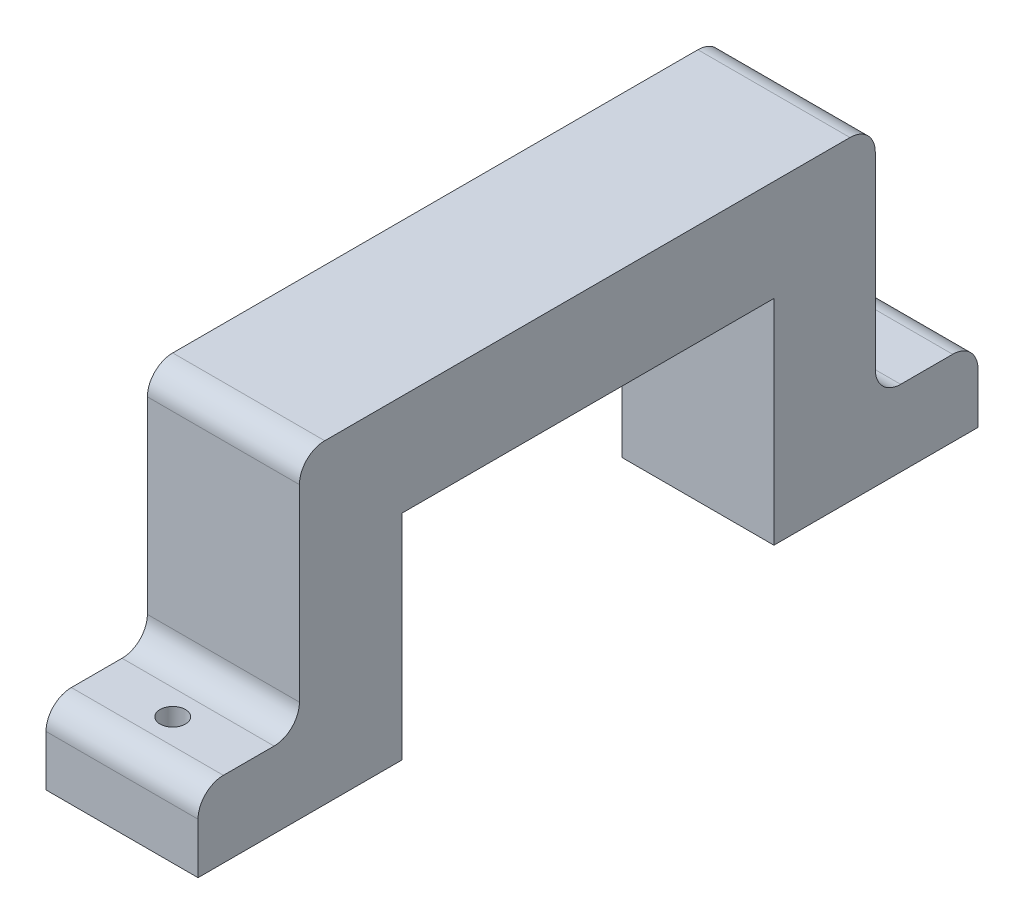
ISO-10303-21;
HEADER;
FILE_DESCRIPTION(('STEP AP214'),'2;1');
FILE_NAME('part.step','',(''),(''),'','','');
FILE_SCHEMA(('AUTOMOTIVE_DESIGN { 1 0 10303 214 1 1 1 1 }'));
ENDSEC;
DATA;
#1=APPLICATION_CONTEXT('core data for automotive mechanical design processes');
#2=APPLICATION_PROTOCOL_DEFINITION('international standard','automotive_design',2000,#1);
#3=PRODUCT_CONTEXT('',#1,'mechanical');
#4=PRODUCT('Part','Part','',(#3));
#5=PRODUCT_RELATED_PRODUCT_CATEGORY('part','',(#4));
#6=PRODUCT_DEFINITION_FORMATION('','',#4);
#7=PRODUCT_DEFINITION_CONTEXT('part definition',#1,'design');
#8=PRODUCT_DEFINITION('design','',#6,#7);
#9=PRODUCT_DEFINITION_SHAPE('','',#8);
#10=(LENGTH_UNIT() NAMED_UNIT(*) SI_UNIT(.MILLI.,.METRE.));
#11=(NAMED_UNIT(*) PLANE_ANGLE_UNIT() SI_UNIT($,.RADIAN.));
#12=(NAMED_UNIT(*) SI_UNIT($,.STERADIAN.) SOLID_ANGLE_UNIT());
#13=UNCERTAINTY_MEASURE_WITH_UNIT(LENGTH_MEASURE(1.E-05),#10,'distance_accuracy_value','');
#14=(GEOMETRIC_REPRESENTATION_CONTEXT(3) GLOBAL_UNCERTAINTY_ASSIGNED_CONTEXT((#13)) GLOBAL_UNIT_ASSIGNED_CONTEXT((#10,
#11,#12)) REPRESENTATION_CONTEXT('',''));
#15=CARTESIAN_POINT('',(0.,0.,0.));
#16=DIRECTION('',(0.,0.,1.));
#17=DIRECTION('',(1.,0.,0.));
#18=AXIS2_PLACEMENT_3D('',#15,#16,#17);
#19=CARTESIAN_POINT('',(9.525,4.7625,0.));
#20=DIRECTION('',(0.,0.,-1.));
#21=DIRECTION('',(0.,1.,0.));
#22=AXIS2_PLACEMENT_3D('',#19,#20,#21);
#23=PLANE('',#22);
#24=DIRECTION('',(0.,-1.,0.));
#25=VECTOR('',#24,1.);
#26=CARTESIAN_POINT('',(9.525,4.7625,0.));
#27=LINE('',#26,#25);
#28=CARTESIAN_POINT('',(9.525,3.175,0.));
#29=VERTEX_POINT('',#28);
#30=CARTESIAN_POINT('',(9.525,0.,0.));
#31=VERTEX_POINT('',#30);
#32=EDGE_CURVE('E164',#29,#31,#27,.T.);
#33=ORIENTED_EDGE('',*,*,#32,.F.);
#34=DIRECTION('',(-1.,0.,0.));
#35=VECTOR('',#34,1.);
#36=CARTESIAN_POINT('',(9.525,3.175,0.));
#37=LINE('',#36,#35);
#38=CARTESIAN_POINT('',(0.,3.175,0.));
#39=VERTEX_POINT('',#38);
#40=EDGE_CURVE('E193',#29,#39,#37,.T.);
#41=ORIENTED_EDGE('',*,*,#40,.T.);
#42=DIRECTION('',(0.,-1.,0.));
#43=VECTOR('',#42,1.);
#44=CARTESIAN_POINT('',(0.,4.7625,0.));
#45=LINE('',#44,#43);
#46=CARTESIAN_POINT('',(0.,0.,0.));
#47=VERTEX_POINT('',#46);
#48=EDGE_CURVE('E190',#39,#47,#45,.T.);
#49=ORIENTED_EDGE('',*,*,#48,.T.);
#50=DIRECTION('',(-1.,0.,0.));
#51=VECTOR('',#50,1.);
#52=CARTESIAN_POINT('',(9.525,0.,0.));
#53=LINE('',#52,#51);
#54=EDGE_CURVE('E182',#31,#47,#53,.T.);
#55=ORIENTED_EDGE('',*,*,#54,.F.);
#56=EDGE_LOOP('',(#33,#41,#49,#55));
#57=FACE_BOUND('',#56,.T.);
#58=ADVANCED_FACE('F39',(#57),#23,.F.);
#59=CARTESIAN_POINT('',(9.525,0.,0.));
#60=DIRECTION('',(0.,1.,0.));
#61=DIRECTION('',(0.,0.,1.));
#62=AXIS2_PLACEMENT_3D('',#59,#60,#61);
#63=PLANE('',#62);
#64=CARTESIAN_POINT('',(4.7625,0.,-3.1756604));
#65=DIRECTION('',(0.,1.,0.));
#66=DIRECTION('',(0.,0.,1.));
#67=AXIS2_PLACEMENT_3D('',#64,#65,#66);
#68=CIRCLE('',#67,0.79375);
#69=CARTESIAN_POINT('',(4.7625,0.,-2.38191039999999));
#70=VERTEX_POINT('',#69);
#71=EDGE_CURVE('E391',#70,#70,#68,.F.);
#72=ORIENTED_EDGE('',*,*,#71,.F.);
#73=EDGE_LOOP('',(#72));
#74=FACE_BOUND('',#73,.T.);
#75=DIRECTION('',(0.,0.,-1.));
#76=VECTOR('',#75,1.);
#77=CARTESIAN_POINT('',(0.,0.,0.));
#78=LINE('',#77,#76);
#79=CARTESIAN_POINT('',(0.,0.,-12.7847852));
#80=VERTEX_POINT('',#79);
#81=EDGE_CURVE('E314',#47,#80,#78,.T.);
#82=ORIENTED_EDGE('',*,*,#81,.T.);
#83=DIRECTION('',(-1.,0.,0.));
#84=VECTOR('',#83,1.);
#85=CARTESIAN_POINT('',(9.525,0.,-12.7847852));
#86=LINE('',#85,#84);
#87=CARTESIAN_POINT('',(9.525,0.,-12.7847852));
#88=VERTEX_POINT('',#87);
#89=EDGE_CURVE('E184',#88,#80,#86,.T.);
#90=ORIENTED_EDGE('',*,*,#89,.F.);
#91=DIRECTION('',(0.,0.,-1.));
#92=VECTOR('',#91,1.);
#93=CARTESIAN_POINT('',(9.525,0.,0.));
#94=LINE('',#93,#92);
#95=EDGE_CURVE('E168',#31,#88,#94,.T.);
#96=ORIENTED_EDGE('',*,*,#95,.F.);
#97=ORIENTED_EDGE('',*,*,#54,.T.);
#98=EDGE_LOOP('',(#82,#90,#96,#97));
#99=FACE_BOUND('',#98,.T.);
#100=ADVANCED_FACE('F181',(#74,#99),#63,.F.);
#101=CARTESIAN_POINT('',(9.525,0.,-12.7847852));
#102=DIRECTION('',(0.,0.,1.));
#103=DIRECTION('',(1.,0.,0.));
#104=AXIS2_PLACEMENT_3D('',#101,#102,#103);
#105=PLANE('',#104);
#106=DIRECTION('',(0.,1.,0.));
#107=VECTOR('',#106,1.);
#108=CARTESIAN_POINT('',(0.,0.,-12.7847852));
#109=LINE('',#108,#107);
#110=CARTESIAN_POINT('',(0.,13.390245,-12.7847852));
#111=VERTEX_POINT('',#110);
#112=EDGE_CURVE('E318',#80,#111,#109,.T.);
#113=ORIENTED_EDGE('',*,*,#112,.T.);
#114=DIRECTION('',(-1.,0.,0.));
#115=VECTOR('',#114,1.);
#116=CARTESIAN_POINT('',(9.525,13.390245,-12.7847852));
#117=LINE('',#116,#115);
#118=CARTESIAN_POINT('',(9.525,13.390245,-12.7847852));
#119=VERTEX_POINT('',#118);
#120=EDGE_CURVE('E199',#119,#111,#117,.T.);
#121=ORIENTED_EDGE('',*,*,#120,.F.);
#122=DIRECTION('',(0.,1.,0.));
#123=VECTOR('',#122,1.);
#124=CARTESIAN_POINT('',(9.525,0.,-12.7847852));
#125=LINE('',#124,#123);
#126=EDGE_CURVE('E187',#88,#119,#125,.T.);
#127=ORIENTED_EDGE('',*,*,#126,.F.);
#128=ORIENTED_EDGE('',*,*,#89,.T.);
#129=EDGE_LOOP('',(#113,#121,#127,#128));
#130=FACE_BOUND('',#129,.T.);
#131=ADVANCED_FACE('F457',(#130),#105,.F.);
#132=CARTESIAN_POINT('',(9.525,13.390245,-12.7847852));
#133=DIRECTION('',(0.,1.,0.));
#134=DIRECTION('',(0.,0.,1.));
#135=AXIS2_PLACEMENT_3D('',#132,#133,#134);
#136=PLANE('',#135);
#137=DIRECTION('',(0.,0.,-1.));
#138=VECTOR('',#137,1.);
#139=CARTESIAN_POINT('',(0.,13.390245,-12.7847852));
#140=LINE('',#139,#138);
#141=CARTESIAN_POINT('',(0.,13.390245,-36.0778552));
#142=VERTEX_POINT('',#141);
#143=EDGE_CURVE('E321',#111,#142,#140,.T.);
#144=ORIENTED_EDGE('',*,*,#143,.T.);
#145=DIRECTION('',(-1.,0.,0.));
#146=VECTOR('',#145,1.);
#147=CARTESIAN_POINT('',(9.525,13.390245,-36.0778552));
#148=LINE('',#147,#146);
#149=CARTESIAN_POINT('',(9.525,13.390245,-36.0778552));
#150=VERTEX_POINT('',#149);
#151=EDGE_CURVE('E352',#150,#142,#148,.T.);
#152=ORIENTED_EDGE('',*,*,#151,.F.);
#153=DIRECTION('',(0.,0.,-1.));
#154=VECTOR('',#153,1.);
#155=CARTESIAN_POINT('',(9.525,13.390245,-12.7847852));
#156=LINE('',#155,#154);
#157=EDGE_CURVE('E363',#119,#150,#156,.T.);
#158=ORIENTED_EDGE('',*,*,#157,.F.);
#159=ORIENTED_EDGE('',*,*,#120,.T.);
#160=EDGE_LOOP('',(#144,#152,#158,#159));
#161=FACE_BOUND('',#160,.T.);
#162=ADVANCED_FACE('F361',(#161),#136,.F.);
#163=CARTESIAN_POINT('',(9.525,13.390245,-36.0778552));
#164=DIRECTION('',(0.,0.,-1.));
#165=DIRECTION('',(-1.,0.,0.));
#166=AXIS2_PLACEMENT_3D('',#163,#164,#165);
#167=PLANE('',#166);
#168=DIRECTION('',(0.,-1.,0.));
#169=VECTOR('',#168,1.);
#170=CARTESIAN_POINT('',(0.,13.390245,-36.0778552));
#171=LINE('',#170,#169);
#172=CARTESIAN_POINT('',(0.,0.,-36.0778552));
#173=VERTEX_POINT('',#172);
#174=EDGE_CURVE('E324',#142,#173,#171,.T.);
#175=ORIENTED_EDGE('',*,*,#174,.T.);
#176=DIRECTION('',(-1.,0.,0.));
#177=VECTOR('',#176,1.);
#178=CARTESIAN_POINT('',(9.525,0.,-36.0778552));
#179=LINE('',#178,#177);
#180=CARTESIAN_POINT('',(9.525,0.,-36.0778552));
#181=VERTEX_POINT('',#180);
#182=EDGE_CURVE('E348',#181,#173,#179,.T.);
#183=ORIENTED_EDGE('',*,*,#182,.F.);
#184=DIRECTION('',(0.,-1.,0.));
#185=VECTOR('',#184,1.);
#186=CARTESIAN_POINT('',(9.525,13.390245,-36.0778552));
#187=LINE('',#186,#185);
#188=EDGE_CURVE('E381',#150,#181,#187,.T.);
#189=ORIENTED_EDGE('',*,*,#188,.F.);
#190=ORIENTED_EDGE('',*,*,#151,.T.);
#191=EDGE_LOOP('',(#175,#183,#189,#190));
#192=FACE_BOUND('',#191,.T.);
#193=ADVANCED_FACE('F371',(#192),#167,.F.);
#194=CARTESIAN_POINT('',(9.525,0.,-48.8626404));
#195=DIRECTION('',(0.,1.,0.));
#196=DIRECTION('',(0.,0.,1.));
#197=AXIS2_PLACEMENT_3D('',#194,#195,#196);
#198=PLANE('',#197);
#199=CARTESIAN_POINT('',(4.7625,0.,-45.6876404));
#200=DIRECTION('',(0.,1.,0.));
#201=DIRECTION('',(0.,0.,1.));
#202=AXIS2_PLACEMENT_3D('',#199,#200,#201);
#203=CIRCLE('',#202,0.507999999999999);
#204=CARTESIAN_POINT('',(4.7625,0.,-45.1796404));
#205=VERTEX_POINT('',#204);
#206=EDGE_CURVE('E315',#205,#205,#203,.F.);
#207=ORIENTED_EDGE('',*,*,#206,.F.);
#208=EDGE_LOOP('',(#207));
#209=FACE_BOUND('',#208,.T.);
#210=DIRECTION('',(0.,0.,-1.));
#211=VECTOR('',#210,1.);
#212=CARTESIAN_POINT('',(0.,0.,-48.8626404));
#213=LINE('',#212,#211);
#214=CARTESIAN_POINT('',(0.,0.,-48.8626404));
#215=VERTEX_POINT('',#214);
#216=EDGE_CURVE('E327',#173,#215,#213,.T.);
#217=ORIENTED_EDGE('',*,*,#216,.T.);
#218=DIRECTION('',(-1.,0.,0.));
#219=VECTOR('',#218,1.);
#220=CARTESIAN_POINT('',(9.525,0.,-48.8626404));
#221=LINE('',#220,#219);
#222=CARTESIAN_POINT('',(9.525,0.,-48.8626404));
#223=VERTEX_POINT('',#222);
#224=EDGE_CURVE('E311',#223,#215,#221,.T.);
#225=ORIENTED_EDGE('',*,*,#224,.F.);
#226=DIRECTION('',(0.,0.,-1.));
#227=VECTOR('',#226,1.);
#228=CARTESIAN_POINT('',(9.525,0.,-48.8626404));
#229=LINE('',#228,#227);
#230=EDGE_CURVE('E377',#181,#223,#229,.T.);
#231=ORIENTED_EDGE('',*,*,#230,.F.);
#232=ORIENTED_EDGE('',*,*,#182,.T.);
#233=EDGE_LOOP('',(#217,#225,#231,#232));
#234=FACE_BOUND('',#233,.T.);
#235=ADVANCED_FACE('F375',(#209,#234),#198,.F.);
#236=CARTESIAN_POINT('',(9.525,4.7625,-48.8626404));
#237=DIRECTION('',(0.,0.,1.));
#238=DIRECTION('',(1.,0.,0.));
#239=AXIS2_PLACEMENT_3D('',#236,#237,#238);
#240=PLANE('',#239);
#241=DIRECTION('',(0.,1.,0.));
#242=VECTOR('',#241,1.);
#243=CARTESIAN_POINT('',(0.,4.7625,-48.8626404));
#244=LINE('',#243,#242);
#245=CARTESIAN_POINT('',(0.,3.175,-48.8626404));
#246=VERTEX_POINT('',#245);
#247=EDGE_CURVE('E284',#215,#246,#244,.T.);
#248=ORIENTED_EDGE('',*,*,#247,.T.);
#249=DIRECTION('',(-1.,0.,0.));
#250=VECTOR('',#249,1.);
#251=CARTESIAN_POINT('',(9.525,3.175,-48.8626404));
#252=LINE('',#251,#250);
#253=CARTESIAN_POINT('',(9.525,3.175,-48.8626404));
#254=VERTEX_POINT('',#253);
#255=EDGE_CURVE('E258',#246,#254,#252,.F.);
#256=ORIENTED_EDGE('',*,*,#255,.T.);
#257=DIRECTION('',(0.,1.,0.));
#258=VECTOR('',#257,1.);
#259=CARTESIAN_POINT('',(9.525,4.7625,-48.8626404));
#260=LINE('',#259,#258);
#261=EDGE_CURVE('E302',#223,#254,#260,.T.);
#262=ORIENTED_EDGE('',*,*,#261,.F.);
#263=ORIENTED_EDGE('',*,*,#224,.T.);
#264=EDGE_LOOP('',(#248,#256,#262,#263));
#265=FACE_BOUND('',#264,.T.);
#266=ADVANCED_FACE('F486',(#265),#240,.F.);
#267=CARTESIAN_POINT('',(9.525,4.7625,-42.4278552));
#268=DIRECTION('',(0.,-1.,0.));
#269=DIRECTION('',(0.,0.,-1.));
#270=AXIS2_PLACEMENT_3D('',#267,#268,#269);
#271=PLANE('',#270);
#272=CARTESIAN_POINT('',(4.7625,4.7625,-45.6876404));
#273=DIRECTION('',(0.,1.,0.));
#274=DIRECTION('',(0.,0.,1.));
#275=AXIS2_PLACEMENT_3D('',#272,#273,#274);
#276=CIRCLE('',#275,0.507999999999999);
#277=CARTESIAN_POINT('',(4.7625,4.7625,-45.1796404));
#278=VERTEX_POINT('',#277);
#279=EDGE_CURVE('E395',#278,#278,#276,.T.);
#280=ORIENTED_EDGE('',*,*,#279,.F.);
#281=EDGE_LOOP('',(#280));
#282=FACE_BOUND('',#281,.T.);
#283=DIRECTION('',(0.,0.,1.));
#284=VECTOR('',#283,1.);
#285=CARTESIAN_POINT('',(9.525,4.7625,-42.4278552));
#286=LINE('',#285,#284);
#287=CARTESIAN_POINT('',(9.525,4.7625,-47.2751404));
#288=VERTEX_POINT('',#287);
#289=CARTESIAN_POINT('',(9.525,4.7625,-44.0153552));
#290=VERTEX_POINT('',#289);
#291=EDGE_CURVE('E291',#288,#290,#286,.T.);
#292=ORIENTED_EDGE('',*,*,#291,.F.);
#293=DIRECTION('',(-1.,0.,0.));
#294=VECTOR('',#293,1.);
#295=CARTESIAN_POINT('',(9.525,4.7625,-47.2751404));
#296=LINE('',#295,#294);
#297=CARTESIAN_POINT('',(0.,4.7625,-47.2751404));
#298=VERTEX_POINT('',#297);
#299=EDGE_CURVE('E254',#288,#298,#296,.T.);
#300=ORIENTED_EDGE('',*,*,#299,.T.);
#301=DIRECTION('',(0.,0.,1.));
#302=VECTOR('',#301,1.);
#303=CARTESIAN_POINT('',(0.,4.7625,-42.4278552));
#304=LINE('',#303,#302);
#305=CARTESIAN_POINT('',(0.,4.7625,-44.0153552));
#306=VERTEX_POINT('',#305);
#307=EDGE_CURVE('E272',#298,#306,#304,.T.);
#308=ORIENTED_EDGE('',*,*,#307,.T.);
#309=DIRECTION('',(-1.,0.,0.));
#310=VECTOR('',#309,1.);
#311=CARTESIAN_POINT('',(9.525,4.7625,-44.0153552));
#312=LINE('',#311,#310);
#313=EDGE_CURVE('E251',#306,#290,#312,.F.);
#314=ORIENTED_EDGE('',*,*,#313,.T.);
#315=EDGE_LOOP('',(#292,#300,#308,#314));
#316=FACE_BOUND('',#315,.T.);
#317=ADVANCED_FACE('F280',(#282,#316),#271,.F.);
#318=CARTESIAN_POINT('',(9.525,19.740245,-42.4278552));
#319=DIRECTION('',(0.,0.,1.));
#320=DIRECTION('',(1.,0.,0.));
#321=AXIS2_PLACEMENT_3D('',#318,#319,#320);
#322=PLANE('',#321);
#323=DIRECTION('',(0.,1.,0.));
#324=VECTOR('',#323,1.);
#325=CARTESIAN_POINT('',(0.,19.740245,-42.4278552));
#326=LINE('',#325,#324);
#327=CARTESIAN_POINT('',(0.,6.35,-42.4278552));
#328=VERTEX_POINT('',#327);
#329=CARTESIAN_POINT('',(0.,18.152745,-42.4278552));
#330=VERTEX_POINT('',#329);
#331=EDGE_CURVE('E274',#328,#330,#326,.T.);
#332=ORIENTED_EDGE('',*,*,#331,.T.);
#333=DIRECTION('',(-1.,0.,0.));
#334=VECTOR('',#333,1.);
#335=CARTESIAN_POINT('',(9.525,18.152745,-42.4278552));
#336=LINE('',#335,#334);
#337=CARTESIAN_POINT('',(9.525,18.152745,-42.4278552));
#338=VERTEX_POINT('',#337);
#339=EDGE_CURVE('E248',#330,#338,#336,.F.);
#340=ORIENTED_EDGE('',*,*,#339,.T.);
#341=DIRECTION('',(0.,1.,0.));
#342=VECTOR('',#341,1.);
#343=CARTESIAN_POINT('',(9.525,19.740245,-42.4278552));
#344=LINE('',#343,#342);
#345=CARTESIAN_POINT('',(9.525,6.35,-42.4278552));
#346=VERTEX_POINT('',#345);
#347=EDGE_CURVE('E289',#346,#338,#344,.T.);
#348=ORIENTED_EDGE('',*,*,#347,.F.);
#349=DIRECTION('',(-1.,0.,0.));
#350=VECTOR('',#349,1.);
#351=CARTESIAN_POINT('',(0.,6.35,-42.4278552));
#352=LINE('',#351,#350);
#353=EDGE_CURVE('E244',#346,#328,#352,.T.);
#354=ORIENTED_EDGE('',*,*,#353,.T.);
#355=EDGE_LOOP('',(#332,#340,#348,#354));
#356=FACE_BOUND('',#355,.T.);
#357=ADVANCED_FACE('F293',(#356),#322,.F.);
#358=CARTESIAN_POINT('',(9.525,19.740245,-6.3509652));
#359=DIRECTION('',(0.,-1.,0.));
#360=DIRECTION('',(0.,0.,-1.));
#361=AXIS2_PLACEMENT_3D('',#358,#359,#360);
#362=PLANE('',#361);
#363=DIRECTION('',(0.,0.,1.));
#364=VECTOR('',#363,1.);
#365=CARTESIAN_POINT('',(0.,19.740245,-6.3509652));
#366=LINE('',#365,#364);
#367=CARTESIAN_POINT('',(0.,19.740245,-40.8403552));
#368=VERTEX_POINT('',#367);
#369=CARTESIAN_POINT('',(0.,19.740245,-7.9384652));
#370=VERTEX_POINT('',#369);
#371=EDGE_CURVE('E335',#368,#370,#366,.T.);
#372=ORIENTED_EDGE('',*,*,#371,.T.);
#373=DIRECTION('',(-1.,0.,0.));
#374=VECTOR('',#373,1.);
#375=CARTESIAN_POINT('',(9.525,19.740245,-7.9384652));
#376=LINE('',#375,#374);
#377=CARTESIAN_POINT('',(9.525,19.740245,-7.93846519999999));
#378=VERTEX_POINT('',#377);
#379=EDGE_CURVE('E241',#370,#378,#376,.F.);
#380=ORIENTED_EDGE('',*,*,#379,.T.);
#381=DIRECTION('',(0.,0.,1.));
#382=VECTOR('',#381,1.);
#383=CARTESIAN_POINT('',(9.525,19.740245,-41.4309052));
#384=LINE('',#383,#382);
#385=CARTESIAN_POINT('',(9.525,19.740245,-40.8403552));
#386=VERTEX_POINT('',#385);
#387=EDGE_CURVE('E296',#386,#378,#384,.T.);
#388=ORIENTED_EDGE('',*,*,#387,.F.);
#389=DIRECTION('',(-1.,0.,0.));
#390=VECTOR('',#389,1.);
#391=CARTESIAN_POINT('',(9.525,19.740245,-40.8403552));
#392=LINE('',#391,#390);
#393=EDGE_CURVE('E237',#386,#368,#392,.T.);
#394=ORIENTED_EDGE('',*,*,#393,.T.);
#395=EDGE_LOOP('',(#372,#380,#388,#394));
#396=FACE_BOUND('',#395,.T.);
#397=ADVANCED_FACE('F585',(#396),#362,.F.);
#398=CARTESIAN_POINT('',(9.525,19.740245,-6.3509652));
#399=DIRECTION('',(0.,0.,-1.));
#400=DIRECTION('',(0.,1.,0.));
#401=AXIS2_PLACEMENT_3D('',#398,#399,#400);
#402=PLANE('',#401);
#403=DIRECTION('',(0.,-1.,0.));
#404=VECTOR('',#403,1.);
#405=CARTESIAN_POINT('',(0.,19.740245,-6.3509652));
#406=LINE('',#405,#404);
#407=CARTESIAN_POINT('',(0.,18.152745,-6.3509652));
#408=VERTEX_POINT('',#407);
#409=CARTESIAN_POINT('',(0.,6.35,-6.3509652));
#410=VERTEX_POINT('',#409);
#411=EDGE_CURVE('E339',#408,#410,#406,.T.);
#412=ORIENTED_EDGE('',*,*,#411,.T.);
#413=DIRECTION('',(-1.,0.,0.));
#414=VECTOR('',#413,1.);
#415=CARTESIAN_POINT('',(9.525,6.35,-6.3509652));
#416=LINE('',#415,#414);
#417=CARTESIAN_POINT('',(9.525,6.35,-6.3509652));
#418=VERTEX_POINT('',#417);
#419=EDGE_CURVE('E55',#410,#418,#416,.F.);
#420=ORIENTED_EDGE('',*,*,#419,.T.);
#421=DIRECTION('',(0.,-1.,0.));
#422=VECTOR('',#421,1.);
#423=CARTESIAN_POINT('',(9.525,19.740245,-6.3509652));
#424=LINE('',#423,#422);
#425=CARTESIAN_POINT('',(9.525,18.152745,-6.3509652));
#426=VERTEX_POINT('',#425);
#427=EDGE_CURVE('E300',#426,#418,#424,.T.);
#428=ORIENTED_EDGE('',*,*,#427,.F.);
#429=DIRECTION('',(-1.,0.,0.));
#430=VECTOR('',#429,1.);
#431=CARTESIAN_POINT('',(9.525,18.152745,-6.3509652));
#432=LINE('',#431,#430);
#433=EDGE_CURVE('E231',#426,#408,#432,.T.);
#434=ORIENTED_EDGE('',*,*,#433,.T.);
#435=EDGE_LOOP('',(#412,#420,#428,#434));
#436=FACE_BOUND('',#435,.T.);
#437=ADVANCED_FACE('F594',(#436),#402,.F.);
#438=CARTESIAN_POINT('',(9.525,4.7625,-6.3509652));
#439=DIRECTION('',(0.,-1.,0.));
#440=DIRECTION('',(0.,0.,-1.));
#441=AXIS2_PLACEMENT_3D('',#438,#439,#440);
#442=PLANE('',#441);
#443=CARTESIAN_POINT('',(4.7625,4.7625,-3.1756604));
#444=DIRECTION('',(0.,1.,0.));
#445=DIRECTION('',(0.,0.,1.));
#446=AXIS2_PLACEMENT_3D('',#443,#444,#445);
#447=CIRCLE('',#446,0.79375);
#448=CARTESIAN_POINT('',(4.7625,4.7625,-2.38191039999999));
#449=VERTEX_POINT('',#448);
#450=EDGE_CURVE('E396',#449,#449,#447,.T.);
#451=ORIENTED_EDGE('',*,*,#450,.F.);
#452=EDGE_LOOP('',(#451));
#453=FACE_BOUND('',#452,.T.);
#454=DIRECTION('',(0.,0.,1.));
#455=VECTOR('',#454,1.);
#456=CARTESIAN_POINT('',(0.,4.7625,-6.3509652));
#457=LINE('',#456,#455);
#458=CARTESIAN_POINT('',(0.,4.7625,-4.7634652));
#459=VERTEX_POINT('',#458);
#460=CARTESIAN_POINT('',(0.,4.7625,-1.5875));
#461=VERTEX_POINT('',#460);
#462=EDGE_CURVE('E177',#459,#461,#457,.T.);
#463=ORIENTED_EDGE('',*,*,#462,.T.);
#464=DIRECTION('',(-1.,0.,0.));
#465=VECTOR('',#464,1.);
#466=CARTESIAN_POINT('',(9.525,4.7625,-1.5875));
#467=LINE('',#466,#465);
#468=CARTESIAN_POINT('',(9.525,4.7625,-1.5875));
#469=VERTEX_POINT('',#468);
#470=EDGE_CURVE('E218',#461,#469,#467,.F.);
#471=ORIENTED_EDGE('',*,*,#470,.T.);
#472=DIRECTION('',(0.,0.,1.));
#473=VECTOR('',#472,1.);
#474=CARTESIAN_POINT('',(9.525,4.7625,-6.3509652));
#475=LINE('',#474,#473);
#476=CARTESIAN_POINT('',(9.525,4.7625,-4.7634652));
#477=VERTEX_POINT('',#476);
#478=EDGE_CURVE('E308',#477,#469,#475,.T.);
#479=ORIENTED_EDGE('',*,*,#478,.F.);
#480=DIRECTION('',(-1.,0.,0.));
#481=VECTOR('',#480,1.);
#482=CARTESIAN_POINT('',(0.,4.7625,-4.7634652));
#483=LINE('',#482,#481);
#484=EDGE_CURVE('E214',#477,#459,#483,.T.);
#485=ORIENTED_EDGE('',*,*,#484,.T.);
#486=EDGE_LOOP('',(#463,#471,#479,#485));
#487=FACE_BOUND('',#486,.T.);
#488=ADVANCED_FACE('F604',(#453,#487),#442,.F.);
#489=CARTESIAN_POINT('',(9.525,0.,0.));
#490=DIRECTION('',(1.,0.,0.));
#491=DIRECTION('',(0.,0.,-1.));
#492=AXIS2_PLACEMENT_3D('',#489,#490,#491);
#493=PLANE('',#492);
#494=ORIENTED_EDGE('',*,*,#478,.T.);
#495=CARTESIAN_POINT('',(9.525,3.175,-1.5875));
#496=DIRECTION('',(1.,0.,0.));
#497=DIRECTION('',(0.,0.,-1.));
#498=AXIS2_PLACEMENT_3D('',#495,#496,#497);
#499=CIRCLE('',#498,1.5875);
#500=EDGE_CURVE('E171',#469,#29,#499,.T.);
#501=ORIENTED_EDGE('',*,*,#500,.T.);
#502=ORIENTED_EDGE('',*,*,#32,.T.);
#503=ORIENTED_EDGE('',*,*,#95,.T.);
#504=ORIENTED_EDGE('',*,*,#126,.T.);
#505=ORIENTED_EDGE('',*,*,#157,.T.);
#506=ORIENTED_EDGE('',*,*,#188,.T.);
#507=ORIENTED_EDGE('',*,*,#230,.T.);
#508=ORIENTED_EDGE('',*,*,#261,.T.);
#509=CARTESIAN_POINT('',(9.525,3.175,-47.2751404));
#510=DIRECTION('',(1.,0.,0.));
#511=DIRECTION('',(0.,0.,-1.));
#512=AXIS2_PLACEMENT_3D('',#509,#510,#511);
#513=CIRCLE('',#512,1.5875);
#514=EDGE_CURVE('E221',#254,#288,#513,.T.);
#515=ORIENTED_EDGE('',*,*,#514,.T.);
#516=ORIENTED_EDGE('',*,*,#291,.T.);
#517=CARTESIAN_POINT('',(9.525,6.35,-44.0153552));
#518=DIRECTION('',(1.,0.,0.));
#519=DIRECTION('',(0.,0.,-1.));
#520=AXIS2_PLACEMENT_3D('',#517,#518,#519);
#521=CIRCLE('',#520,1.5875);
#522=EDGE_CURVE('E11',#290,#346,#521,.F.);
#523=ORIENTED_EDGE('',*,*,#522,.T.);
#524=ORIENTED_EDGE('',*,*,#347,.T.);
#525=CARTESIAN_POINT('',(9.525,18.152745,-40.8403552));
#526=DIRECTION('',(1.,0.,0.));
#527=DIRECTION('',(0.,0.,-1.));
#528=AXIS2_PLACEMENT_3D('',#525,#526,#527);
#529=CIRCLE('',#528,1.5875);
#530=EDGE_CURVE('E224',#338,#386,#529,.T.);
#531=ORIENTED_EDGE('',*,*,#530,.T.);
#532=ORIENTED_EDGE('',*,*,#387,.T.);
#533=CARTESIAN_POINT('',(9.525,18.152745,-7.9384652));
#534=DIRECTION('',(1.,0.,0.));
#535=DIRECTION('',(0.,0.,-1.));
#536=AXIS2_PLACEMENT_3D('',#533,#534,#535);
#537=CIRCLE('',#536,1.5875);
#538=EDGE_CURVE('E62',#378,#426,#537,.T.);
#539=ORIENTED_EDGE('',*,*,#538,.T.);
#540=ORIENTED_EDGE('',*,*,#427,.T.);
#541=CARTESIAN_POINT('',(9.525,6.35,-4.7634652));
#542=DIRECTION('',(1.,0.,0.));
#543=DIRECTION('',(0.,0.,-1.));
#544=AXIS2_PLACEMENT_3D('',#541,#542,#543);
#545=CIRCLE('',#544,1.5875);
#546=EDGE_CURVE('E264',#418,#477,#545,.F.);
#547=ORIENTED_EDGE('',*,*,#546,.T.);
#548=EDGE_LOOP('',(#494,#501,#502,#503,#504,#505,#506,#507,#508,#515,#516,#523,#524,#531,#532,
#539,#540,#547));
#549=FACE_BOUND('',#548,.T.);
#550=ADVANCED_FACE('F167',(#549),#493,.T.);
#551=CARTESIAN_POINT('',(0.,0.,0.));
#552=DIRECTION('',(1.,0.,0.));
#553=DIRECTION('',(0.,0.,-1.));
#554=AXIS2_PLACEMENT_3D('',#551,#552,#553);
#555=PLANE('',#554);
#556=CARTESIAN_POINT('',(0.,6.68528,-38.3232152));
#557=DIRECTION('',(-1.,0.,0.));
#558=DIRECTION('',(0.,0.,1.));
#559=AXIS2_PLACEMENT_3D('',#556,#557,#558);
#560=CIRCLE('',#559,0.508000000000002);
#561=CARTESIAN_POINT('',(0.,6.68528,-37.8152152));
#562=VERTEX_POINT('',#561);
#563=EDGE_CURVE('E415',#562,#562,#560,.T.);
#564=ORIENTED_EDGE('',*,*,#563,.F.);
#565=EDGE_LOOP('',(#564));
#566=FACE_BOUND('',#565,.T.);
#567=CARTESIAN_POINT('',(0.,6.6951225,-10.5229152));
#568=DIRECTION('',(-1.,0.,0.));
#569=DIRECTION('',(0.,0.,1.));
#570=AXIS2_PLACEMENT_3D('',#567,#568,#569);
#571=CIRCLE('',#570,0.508000000000002);
#572=CARTESIAN_POINT('',(0.,6.6951225,-10.0149152));
#573=VERTEX_POINT('',#572);
#574=EDGE_CURVE('E407',#573,#573,#571,.T.);
#575=ORIENTED_EDGE('',*,*,#574,.F.);
#576=EDGE_LOOP('',(#575));
#577=FACE_BOUND('',#576,.T.);
#578=ORIENTED_EDGE('',*,*,#48,.F.);
#579=CARTESIAN_POINT('',(0.,3.175,-1.5875));
#580=DIRECTION('',(1.,0.,0.));
#581=DIRECTION('',(0.,0.,-1.));
#582=AXIS2_PLACEMENT_3D('',#579,#580,#581);
#583=CIRCLE('',#582,1.5875);
#584=EDGE_CURVE('E211',#39,#461,#583,.F.);
#585=ORIENTED_EDGE('',*,*,#584,.T.);
#586=ORIENTED_EDGE('',*,*,#462,.F.);
#587=CARTESIAN_POINT('',(0.,6.35,-4.7634652));
#588=DIRECTION('',(1.,0.,0.));
#589=DIRECTION('',(0.,0.,-1.));
#590=AXIS2_PLACEMENT_3D('',#587,#588,#589);
#591=CIRCLE('',#590,1.5875);
#592=EDGE_CURVE('E261',#459,#410,#591,.T.);
#593=ORIENTED_EDGE('',*,*,#592,.T.);
#594=ORIENTED_EDGE('',*,*,#411,.F.);
#595=CARTESIAN_POINT('',(0.,18.152745,-7.9384652));
#596=DIRECTION('',(1.,0.,0.));
#597=DIRECTION('',(0.,0.,-1.));
#598=AXIS2_PLACEMENT_3D('',#595,#596,#597);
#599=CIRCLE('',#598,1.5875);
#600=EDGE_CURVE('E208',#408,#370,#599,.F.);
#601=ORIENTED_EDGE('',*,*,#600,.T.);
#602=ORIENTED_EDGE('',*,*,#371,.F.);
#603=CARTESIAN_POINT('',(0.,18.152745,-40.8403552));
#604=DIRECTION('',(1.,0.,0.));
#605=DIRECTION('',(0.,0.,-1.));
#606=AXIS2_PLACEMENT_3D('',#603,#604,#605);
#607=CIRCLE('',#606,1.5875);
#608=EDGE_CURVE('E205',#368,#330,#607,.F.);
#609=ORIENTED_EDGE('',*,*,#608,.T.);
#610=ORIENTED_EDGE('',*,*,#331,.F.);
#611=CARTESIAN_POINT('',(0.,6.35,-44.0153552));
#612=DIRECTION('',(1.,0.,0.));
#613=DIRECTION('',(0.,0.,-1.));
#614=AXIS2_PLACEMENT_3D('',#611,#612,#613);
#615=CIRCLE('',#614,1.5875);
#616=EDGE_CURVE('E48',#328,#306,#615,.T.);
#617=ORIENTED_EDGE('',*,*,#616,.T.);
#618=ORIENTED_EDGE('',*,*,#307,.F.);
#619=CARTESIAN_POINT('',(0.,3.175,-47.2751404));
#620=DIRECTION('',(1.,0.,0.));
#621=DIRECTION('',(0.,0.,-1.));
#622=AXIS2_PLACEMENT_3D('',#619,#620,#621);
#623=CIRCLE('',#622,1.5875);
#624=EDGE_CURVE('E197',#298,#246,#623,.F.);
#625=ORIENTED_EDGE('',*,*,#624,.T.);
#626=ORIENTED_EDGE('',*,*,#247,.F.);
#627=ORIENTED_EDGE('',*,*,#216,.F.);
#628=ORIENTED_EDGE('',*,*,#174,.F.);
#629=ORIENTED_EDGE('',*,*,#143,.F.);
#630=ORIENTED_EDGE('',*,*,#112,.F.);
#631=ORIENTED_EDGE('',*,*,#81,.F.);
#632=EDGE_LOOP('',(#578,#585,#586,#593,#594,#601,#602,#609,#610,#617,#618,#625,#626,#627,#628,
#629,#630,#631));
#633=FACE_BOUND('',#632,.T.);
#634=ADVANCED_FACE('F271',(#566,#577,#633),#555,.F.);
#635=CARTESIAN_POINT('',(4.7625,-0.00100000000000187,-3.1756604));
#636=DIRECTION('',(0.,1.,0.));
#637=DIRECTION('',(0.,0.,1.));
#638=AXIS2_PLACEMENT_3D('',#635,#636,#637);
#639=CYLINDRICAL_SURFACE('',#638,0.79375);
#640=ORIENTED_EDGE('',*,*,#450,.T.);
#641=EDGE_LOOP('',(#640));
#642=FACE_BOUND('',#641,.T.);
#643=ORIENTED_EDGE('',*,*,#71,.T.);
#644=EDGE_LOOP('',(#643));
#645=FACE_BOUND('',#644,.T.);
#646=ADVANCED_FACE('F434',(#642,#645),#639,.F.);
#647=CARTESIAN_POINT('',(4.7625,-0.00100000000000187,-45.6876404));
#648=DIRECTION('',(0.,1.,0.));
#649=DIRECTION('',(0.,0.,1.));
#650=AXIS2_PLACEMENT_3D('',#647,#648,#649);
#651=CYLINDRICAL_SURFACE('',#650,0.507999999999999);
#652=ORIENTED_EDGE('',*,*,#279,.T.);
#653=EDGE_LOOP('',(#652));
#654=FACE_BOUND('',#653,.T.);
#655=ORIENTED_EDGE('',*,*,#206,.T.);
#656=EDGE_LOOP('',(#655));
#657=FACE_BOUND('',#656,.T.);
#658=ADVANCED_FACE('F440',(#654,#657),#651,.F.);
#659=CARTESIAN_POINT('',(6.35,6.6951225,-10.5229152));
#660=DIRECTION('',(-1.,0.,0.));
#661=DIRECTION('',(0.,0.,1.));
#662=AXIS2_PLACEMENT_3D('',#659,#660,#661);
#663=CYLINDRICAL_SURFACE('',#662,0.508000000000002);
#664=CARTESIAN_POINT('',(6.35,6.6951225,-10.5229152));
#665=DIRECTION('',(-1.,0.,0.));
#666=DIRECTION('',(0.,0.,1.));
#667=AXIS2_PLACEMENT_3D('',#664,#665,#666);
#668=CIRCLE('',#667,0.508000000000002);
#669=CARTESIAN_POINT('',(6.35,6.6951225,-10.0149152));
#670=VERTEX_POINT('',#669);
#671=EDGE_CURVE('E411',#670,#670,#668,.T.);
#672=ORIENTED_EDGE('',*,*,#671,.F.);
#673=EDGE_LOOP('',(#672));
#674=FACE_BOUND('',#673,.T.);
#675=ORIENTED_EDGE('',*,*,#574,.T.);
#676=EDGE_LOOP('',(#675));
#677=FACE_BOUND('',#676,.T.);
#678=ADVANCED_FACE('F438',(#674,#677),#663,.F.);
#679=CARTESIAN_POINT('',(6.35,6.6951225,-10.5229152));
#680=DIRECTION('',(-1.,0.,0.));
#681=DIRECTION('',(0.,0.,1.));
#682=AXIS2_PLACEMENT_3D('',#679,#680,#681);
#683=PLANE('',#682);
#684=ORIENTED_EDGE('',*,*,#671,.T.);
#685=EDGE_LOOP('',(#684));
#686=FACE_BOUND('',#685,.T.);
#687=ADVANCED_FACE('F428',(#686),#683,.T.);
#688=CARTESIAN_POINT('',(6.35,6.68528,-38.3232152));
#689=DIRECTION('',(-1.,0.,0.));
#690=DIRECTION('',(0.,0.,1.));
#691=AXIS2_PLACEMENT_3D('',#688,#689,#690);
#692=CYLINDRICAL_SURFACE('',#691,0.508000000000002);
#693=CARTESIAN_POINT('',(6.35,6.68528,-38.3232152));
#694=DIRECTION('',(-1.,0.,0.));
#695=DIRECTION('',(0.,0.,1.));
#696=AXIS2_PLACEMENT_3D('',#693,#694,#695);
#697=CIRCLE('',#696,0.508000000000002);
#698=CARTESIAN_POINT('',(6.35,6.68528,-37.8152152));
#699=VERTEX_POINT('',#698);
#700=EDGE_CURVE('E400',#699,#699,#697,.T.);
#701=ORIENTED_EDGE('',*,*,#700,.F.);
#702=EDGE_LOOP('',(#701));
#703=FACE_BOUND('',#702,.T.);
#704=ORIENTED_EDGE('',*,*,#563,.T.);
#705=EDGE_LOOP('',(#704));
#706=FACE_BOUND('',#705,.T.);
#707=ADVANCED_FACE('F425',(#703,#706),#692,.F.);
#708=CARTESIAN_POINT('',(6.35,6.68528,-38.3232152));
#709=DIRECTION('',(-1.,0.,0.));
#710=DIRECTION('',(0.,0.,1.));
#711=AXIS2_PLACEMENT_3D('',#708,#709,#710);
#712=PLANE('',#711);
#713=ORIENTED_EDGE('',*,*,#700,.T.);
#714=EDGE_LOOP('',(#713));
#715=FACE_BOUND('',#714,.T.);
#716=ADVANCED_FACE('F423',(#715),#712,.T.);
#717=CARTESIAN_POINT('',(9.525,3.175,-1.5875));
#718=DIRECTION('',(-1.,0.,0.));
#719=DIRECTION('',(0.,0.,1.));
#720=AXIS2_PLACEMENT_3D('',#717,#718,#719);
#721=CYLINDRICAL_SURFACE('',#720,1.5875);
#722=ORIENTED_EDGE('',*,*,#500,.F.);
#723=ORIENTED_EDGE('',*,*,#470,.F.);
#724=ORIENTED_EDGE('',*,*,#584,.F.);
#725=ORIENTED_EDGE('',*,*,#40,.F.);
#726=EDGE_LOOP('',(#722,#723,#724,#725));
#727=FACE_BOUND('',#726,.T.);
#728=ADVANCED_FACE('F462',(#727),#721,.T.);
#729=CARTESIAN_POINT('',(9.525,6.35,-4.7634652));
#730=DIRECTION('',(1.,0.,0.));
#731=DIRECTION('',(0.,0.,-1.));
#732=AXIS2_PLACEMENT_3D('',#729,#730,#731);
#733=CYLINDRICAL_SURFACE('',#732,1.5875);
#734=ORIENTED_EDGE('',*,*,#546,.F.);
#735=ORIENTED_EDGE('',*,*,#419,.F.);
#736=ORIENTED_EDGE('',*,*,#592,.F.);
#737=ORIENTED_EDGE('',*,*,#484,.F.);
#738=EDGE_LOOP('',(#734,#735,#736,#737));
#739=FACE_BOUND('',#738,.T.);
#740=ADVANCED_FACE('F465',(#739),#733,.F.);
#741=CARTESIAN_POINT('',(9.525,18.152745,-7.9384652));
#742=DIRECTION('',(-1.,0.,0.));
#743=DIRECTION('',(0.,0.,1.));
#744=AXIS2_PLACEMENT_3D('',#741,#742,#743);
#745=CYLINDRICAL_SURFACE('',#744,1.5875);
#746=ORIENTED_EDGE('',*,*,#538,.F.);
#747=ORIENTED_EDGE('',*,*,#379,.F.);
#748=ORIENTED_EDGE('',*,*,#600,.F.);
#749=ORIENTED_EDGE('',*,*,#433,.F.);
#750=EDGE_LOOP('',(#746,#747,#748,#749));
#751=FACE_BOUND('',#750,.T.);
#752=ADVANCED_FACE('F469',(#751),#745,.T.);
#753=CARTESIAN_POINT('',(9.525,18.152745,-40.8403552));
#754=DIRECTION('',(-1.,0.,0.));
#755=DIRECTION('',(0.,0.,1.));
#756=AXIS2_PLACEMENT_3D('',#753,#754,#755);
#757=CYLINDRICAL_SURFACE('',#756,1.5875);
#758=ORIENTED_EDGE('',*,*,#530,.F.);
#759=ORIENTED_EDGE('',*,*,#339,.F.);
#760=ORIENTED_EDGE('',*,*,#608,.F.);
#761=ORIENTED_EDGE('',*,*,#393,.F.);
#762=EDGE_LOOP('',(#758,#759,#760,#761));
#763=FACE_BOUND('',#762,.T.);
#764=ADVANCED_FACE('F473',(#763),#757,.T.);
#765=CARTESIAN_POINT('',(9.525,3.175,-47.2751404));
#766=DIRECTION('',(-1.,0.,0.));
#767=DIRECTION('',(0.,0.,1.));
#768=AXIS2_PLACEMENT_3D('',#765,#766,#767);
#769=CYLINDRICAL_SURFACE('',#768,1.5875);
#770=ORIENTED_EDGE('',*,*,#514,.F.);
#771=ORIENTED_EDGE('',*,*,#255,.F.);
#772=ORIENTED_EDGE('',*,*,#624,.F.);
#773=ORIENTED_EDGE('',*,*,#299,.F.);
#774=EDGE_LOOP('',(#770,#771,#772,#773));
#775=FACE_BOUND('',#774,.T.);
#776=ADVANCED_FACE('F476',(#775),#769,.T.);
#777=CARTESIAN_POINT('',(9.525,6.35,-44.0153552));
#778=DIRECTION('',(1.,0.,0.));
#779=DIRECTION('',(0.,0.,-1.));
#780=AXIS2_PLACEMENT_3D('',#777,#778,#779);
#781=CYLINDRICAL_SURFACE('',#780,1.5875);
#782=ORIENTED_EDGE('',*,*,#522,.F.);
#783=ORIENTED_EDGE('',*,*,#313,.F.);
#784=ORIENTED_EDGE('',*,*,#616,.F.);
#785=ORIENTED_EDGE('',*,*,#353,.F.);
#786=EDGE_LOOP('',(#782,#783,#784,#785));
#787=FACE_BOUND('',#786,.T.);
#788=ADVANCED_FACE('F41',(#787),#781,.F.);
#789=CLOSED_SHELL('',(#58,#100,#131,#162,#193,#235,#266,#317,#357,#397,#437,#488,#550,#634,#646,
#658,#678,#687,#707,#716,#728,#740,#752,#764,#776,#788));
#790=MANIFOLD_SOLID_BREP('B2',#789);
#791=ADVANCED_BREP_SHAPE_REPRESENTATION('',(#18,#790),#14);
#792=SHAPE_DEFINITION_REPRESENTATION(#9,#791);
ENDSEC;
END-ISO-10303-21;
